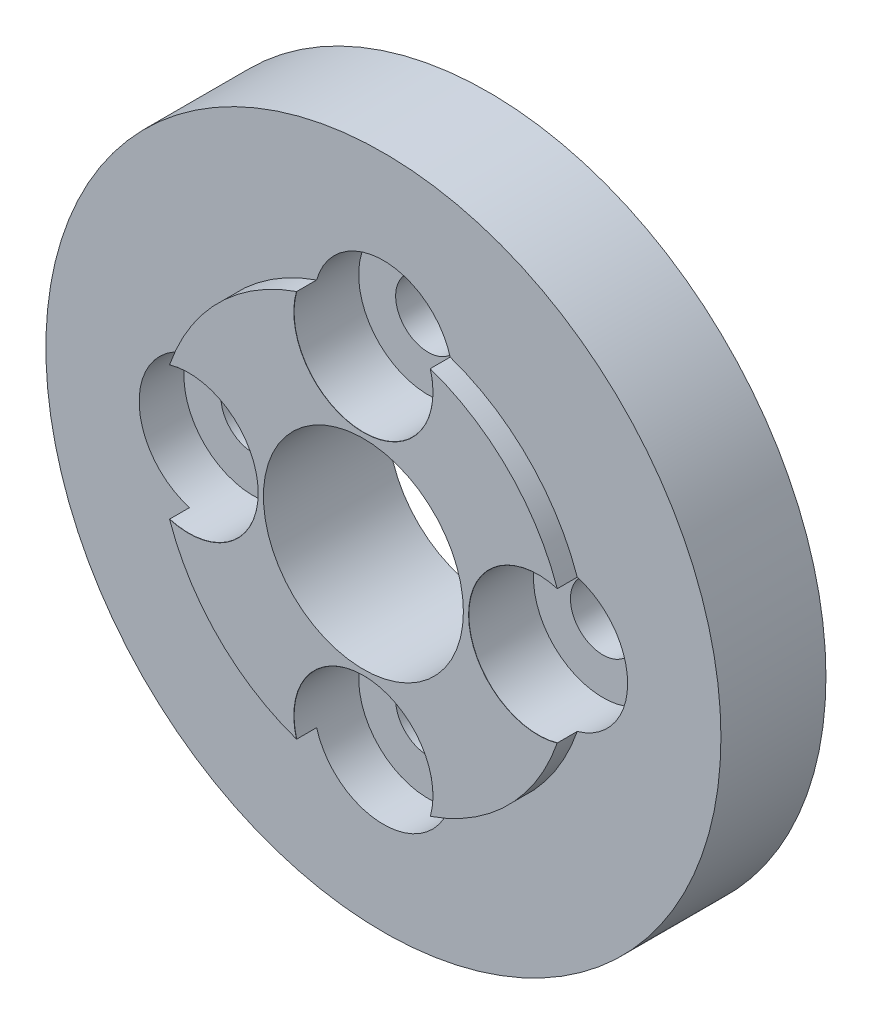
ISO-10303-21;
HEADER;
FILE_DESCRIPTION(('STEP AP214'),'2;1');
FILE_NAME('part.step','',(''),(''),'','','');
FILE_SCHEMA(('AUTOMOTIVE_DESIGN { 1 0 10303 214 1 1 1 1 }'));
ENDSEC;
DATA;
#1=APPLICATION_CONTEXT('core data for automotive mechanical design processes');
#2=APPLICATION_PROTOCOL_DEFINITION('international standard','automotive_design',2000,#1);
#3=PRODUCT_CONTEXT('',#1,'mechanical');
#4=PRODUCT('Part','Part','',(#3));
#5=PRODUCT_RELATED_PRODUCT_CATEGORY('part','',(#4));
#6=PRODUCT_DEFINITION_FORMATION('','',#4);
#7=PRODUCT_DEFINITION_CONTEXT('part definition',#1,'design');
#8=PRODUCT_DEFINITION('design','',#6,#7);
#9=PRODUCT_DEFINITION_SHAPE('','',#8);
#10=(LENGTH_UNIT() NAMED_UNIT(*) SI_UNIT(.MILLI.,.METRE.));
#11=(NAMED_UNIT(*) PLANE_ANGLE_UNIT() SI_UNIT($,.RADIAN.));
#12=(NAMED_UNIT(*) SI_UNIT($,.STERADIAN.) SOLID_ANGLE_UNIT());
#13=UNCERTAINTY_MEASURE_WITH_UNIT(LENGTH_MEASURE(1.E-05),#10,'distance_accuracy_value','');
#14=(GEOMETRIC_REPRESENTATION_CONTEXT(3) GLOBAL_UNCERTAINTY_ASSIGNED_CONTEXT((#13)) GLOBAL_UNIT_ASSIGNED_CONTEXT((#10,
#11,#12)) REPRESENTATION_CONTEXT('',''));
#15=CARTESIAN_POINT('',(0.,0.,0.));
#16=DIRECTION('',(0.,0.,1.));
#17=DIRECTION('',(1.,0.,0.));
#18=AXIS2_PLACEMENT_3D('',#15,#16,#17);
#19=CARTESIAN_POINT('',(0.,0.,25.));
#20=DIRECTION('',(0.,0.,-1.));
#21=DIRECTION('',(-1.,0.,0.));
#22=AXIS2_PLACEMENT_3D('',#19,#20,#21);
#23=CYLINDRICAL_SURFACE('',#22,41.);
#24=CARTESIAN_POINT('',(38.7535008434906,13.3852968728219,25.0002));
#25=CARTESIAN_POINT('',(38.7551865109238,13.3804164798747,24.9959662065485));
#26=CARTESIAN_POINT('',(38.7568713176971,13.3755355905067,24.9917326431561));
#27=CARTESIAN_POINT('',(38.7602392099241,13.3657728189289,24.9832659764895));
#28=CARTESIAN_POINT('',(38.7619222953778,13.3608909367192,24.9790328732152));
#29=CARTESIAN_POINT('',(38.7636045201715,13.3560085580886,24.9748));
#30=B_SPLINE_CURVE_WITH_KNOTS('',3,(#24,#25,#26,#27,#28,#29),.UNSPECIFIED.,.F.,.F.,(4,2,4),(0.,
0.0200315357612623,0.040063071522703),.UNSPECIFIED.);
#31=CARTESIAN_POINT('',(38.7535804721029,13.3850663275252,25.));
#32=VERTEX_POINT('',#31);
#33=CARTESIAN_POINT('',(38.7635250357652,13.3562392461951,24.975));
#34=VERTEX_POINT('',#33);
#35=EDGE_CURVE('E48',#32,#34,#30,.T.);
#36=ORIENTED_EDGE('',*,*,#35,.T.);
#37=DIRECTION('',(0.,0.,1.));
#38=VECTOR('',#37,1.);
#39=CARTESIAN_POINT('',(38.7635250357652,13.3562392461951,18.5125));
#40=LINE('',#39,#38);
#41=CARTESIAN_POINT('',(38.7635250357652,13.3562392461951,21.));
#42=VERTEX_POINT('',#41);
#43=EDGE_CURVE('E11',#34,#42,#40,.F.);
#44=ORIENTED_EDGE('',*,*,#43,.T.);
#45=CARTESIAN_POINT('',(0.,0.,21.));
#46=DIRECTION('',(0.,0.,1.));
#47=DIRECTION('',(1.,0.,0.));
#48=AXIS2_PLACEMENT_3D('',#45,#46,#47);
#49=CIRCLE('',#48,41.);
#50=CARTESIAN_POINT('',(13.3562392461947,38.7635250357654,21.));
#51=VERTEX_POINT('',#50);
#52=EDGE_CURVE('E286',#42,#51,#49,.T.);
#53=ORIENTED_EDGE('',*,*,#52,.T.);
#54=DIRECTION('',(0.,0.,1.));
#55=VECTOR('',#54,1.);
#56=CARTESIAN_POINT('',(13.3562392461947,38.7635250357654,18.5125));
#57=LINE('',#56,#55);
#58=CARTESIAN_POINT('',(13.3562392461947,38.7635250357654,24.975));
#59=VERTEX_POINT('',#58);
#60=EDGE_CURVE('E249',#51,#59,#57,.T.);
#61=ORIENTED_EDGE('',*,*,#60,.T.);
#62=CARTESIAN_POINT('',(13.3560085580882,38.7636045201717,24.9748));
#63=CARTESIAN_POINT('',(13.3608909367188,38.7619222953779,24.9790328732152));
#64=CARTESIAN_POINT('',(13.3657728189285,38.7602392099243,24.9832659764895));
#65=CARTESIAN_POINT('',(13.3755355905063,38.7568713176973,24.9917326431561));
#66=CARTESIAN_POINT('',(13.3804164798743,38.7551865109239,24.9959662065485));
#67=CARTESIAN_POINT('',(13.3852968728215,38.7535008434907,25.0002));
#68=B_SPLINE_CURVE_WITH_KNOTS('',3,(#62,#63,#64,#65,#66,#67),.UNSPECIFIED.,.F.,.F.,(4,2,4),(0.,
0.0200315357614394,0.0400630715226987),.UNSPECIFIED.);
#69=CARTESIAN_POINT('',(13.3850663275247,38.753580472103,25.));
#70=VERTEX_POINT('',#69);
#71=EDGE_CURVE('E261',#59,#70,#68,.T.);
#72=ORIENTED_EDGE('',*,*,#71,.T.);
#73=CARTESIAN_POINT('',(0.,0.,25.));
#74=DIRECTION('',(0.,0.,1.));
#75=DIRECTION('',(1.,0.,0.));
#76=AXIS2_PLACEMENT_3D('',#73,#74,#75);
#77=CIRCLE('',#76,41.);
#78=EDGE_CURVE('E144',#32,#70,#77,.T.);
#79=ORIENTED_EDGE('',*,*,#78,.F.);
#80=EDGE_LOOP('',(#36,#44,#53,#61,#72,#79));
#81=FACE_BOUND('',#80,.T.);
#82=ADVANCED_FACE('F39',(#81),#23,.T.);
#83=CARTESIAN_POINT('',(13.3562392461947,-38.7635250357654,21.));
#84=VERTEX_POINT('',#83);
#85=CARTESIAN_POINT('',(38.7635250357655,-13.3562392461943,21.));
#86=VERTEX_POINT('',#85);
#87=EDGE_CURVE('E377',#84,#86,#49,.T.);
#88=ORIENTED_EDGE('',*,*,#87,.T.);
#89=DIRECTION('',(0.,0.,1.));
#90=VECTOR('',#89,1.);
#91=CARTESIAN_POINT('',(38.7635250357655,-13.3562392461943,18.5125));
#92=LINE('',#91,#90);
#93=CARTESIAN_POINT('',(38.7635250357655,-13.3562392461943,24.975));
#94=VERTEX_POINT('',#93);
#95=EDGE_CURVE('E146',#86,#94,#92,.T.);
#96=ORIENTED_EDGE('',*,*,#95,.T.);
#97=CARTESIAN_POINT('',(38.7636045201718,-13.3560085580878,24.9748));
#98=CARTESIAN_POINT('',(38.761922295378,-13.3608909367184,24.9790328732152));
#99=CARTESIAN_POINT('',(38.7602392099244,-13.3657728189281,24.9832659764895));
#100=CARTESIAN_POINT('',(38.7568713176974,-13.3755355905059,24.9917326431561));
#101=CARTESIAN_POINT('',(38.7551865109241,-13.3804164798739,24.9959662065485));
#102=CARTESIAN_POINT('',(38.7535008434908,-13.3852968728211,25.0002));
#103=B_SPLINE_CURVE_WITH_KNOTS('',3,(#97,#98,#99,#100,#101,#102),.UNSPECIFIED.,.F.,.F.,(4,2,4),
(0.,0.0200315357614416,0.0400630715227),.UNSPECIFIED.);
#104=CARTESIAN_POINT('',(38.7535804721031,-13.3850663275243,25.));
#105=VERTEX_POINT('',#104);
#106=EDGE_CURVE('E138',#94,#105,#103,.T.);
#107=ORIENTED_EDGE('',*,*,#106,.T.);
#108=CARTESIAN_POINT('',(13.3850663275247,-38.753580472103,25.));
#109=VERTEX_POINT('',#108);
#110=EDGE_CURVE('E383',#109,#105,#77,.T.);
#111=ORIENTED_EDGE('',*,*,#110,.F.);
#112=CARTESIAN_POINT('',(13.3852968728215,-38.7535008434907,25.0002));
#113=CARTESIAN_POINT('',(13.3804164798743,-38.7551865109239,24.9959662065485));
#114=CARTESIAN_POINT('',(13.3755355905063,-38.7568713176973,24.9917326431561));
#115=CARTESIAN_POINT('',(13.3657728189285,-38.7602392099243,24.9832659764895));
#116=CARTESIAN_POINT('',(13.3608909367188,-38.7619222953779,24.9790328732152));
#117=CARTESIAN_POINT('',(13.3560085580882,-38.7636045201717,24.9748));
#118=B_SPLINE_CURVE_WITH_KNOTS('',3,(#112,#113,#114,#115,#116,#117),.UNSPECIFIED.,.F.,.F.,(4,2,
4),(0.,0.0200315357612606,0.0400630715227018),.UNSPECIFIED.);
#119=CARTESIAN_POINT('',(13.3562392461947,-38.7635250357654,24.975));
#120=VERTEX_POINT('',#119);
#121=EDGE_CURVE('E176',#109,#120,#118,.T.);
#122=ORIENTED_EDGE('',*,*,#121,.T.);
#123=DIRECTION('',(0.,0.,1.));
#124=VECTOR('',#123,1.);
#125=CARTESIAN_POINT('',(13.3562392461947,-38.7635250357654,18.5125));
#126=LINE('',#125,#124);
#127=EDGE_CURVE('E172',#120,#84,#126,.F.);
#128=ORIENTED_EDGE('',*,*,#127,.T.);
#129=EDGE_LOOP('',(#88,#96,#107,#111,#122,#128));
#130=FACE_BOUND('',#129,.T.);
#131=ADVANCED_FACE('F406',(#130),#23,.T.);
#132=CARTESIAN_POINT('',(-38.7635250357653,-13.3562392461948,21.));
#133=VERTEX_POINT('',#132);
#134=CARTESIAN_POINT('',(-13.3562392461947,-38.7635250357654,21.));
#135=VERTEX_POINT('',#134);
#136=EDGE_CURVE('E285',#133,#135,#49,.T.);
#137=ORIENTED_EDGE('',*,*,#136,.T.);
#138=DIRECTION('',(0.,0.,1.));
#139=VECTOR('',#138,1.);
#140=CARTESIAN_POINT('',(-13.3562392461947,-38.7635250357654,18.5125));
#141=LINE('',#140,#139);
#142=CARTESIAN_POINT('',(-13.3562392461947,-38.7635250357654,24.975));
#143=VERTEX_POINT('',#142);
#144=EDGE_CURVE('E185',#135,#143,#141,.T.);
#145=ORIENTED_EDGE('',*,*,#144,.T.);
#146=CARTESIAN_POINT('',(-13.3560085580882,-38.7636045201717,24.9748));
#147=CARTESIAN_POINT('',(-13.3608909367188,-38.7619222953779,24.9790328732152));
#148=CARTESIAN_POINT('',(-13.3657728189285,-38.7602392099243,24.9832659764895));
#149=CARTESIAN_POINT('',(-13.3755355905063,-38.7568713176973,24.9917326431561));
#150=CARTESIAN_POINT('',(-13.3804164798743,-38.7551865109239,24.9959662065485));
#151=CARTESIAN_POINT('',(-13.3852968728215,-38.7535008434907,25.0002));
#152=B_SPLINE_CURVE_WITH_KNOTS('',3,(#146,#147,#148,#149,#150,#151),.UNSPECIFIED.,.F.,.F.,(4,2,
4),(0.,0.0200315357614394,0.0400630715226987),.UNSPECIFIED.);
#153=CARTESIAN_POINT('',(-13.3850663275247,-38.753580472103,25.));
#154=VERTEX_POINT('',#153);
#155=EDGE_CURVE('E196',#143,#154,#152,.T.);
#156=ORIENTED_EDGE('',*,*,#155,.T.);
#157=CARTESIAN_POINT('',(-38.753580472103,-13.3850663275249,25.));
#158=VERTEX_POINT('',#157);
#159=EDGE_CURVE('E290',#158,#154,#77,.T.);
#160=ORIENTED_EDGE('',*,*,#159,.F.);
#161=CARTESIAN_POINT('',(-38.7535008434907,-13.3852968728217,25.0002));
#162=CARTESIAN_POINT('',(-38.7551865109239,-13.3804164798745,24.9959662065485));
#163=CARTESIAN_POINT('',(-38.7568713176972,-13.3755355905064,24.9917326431561));
#164=CARTESIAN_POINT('',(-38.7602392099242,-13.3657728189287,24.9832659764895));
#165=CARTESIAN_POINT('',(-38.7619222953779,-13.3608909367189,24.9790328732152));
#166=CARTESIAN_POINT('',(-38.7636045201716,-13.3560085580884,24.9748));
#167=B_SPLINE_CURVE_WITH_KNOTS('',3,(#161,#162,#163,#164,#165,#166),.UNSPECIFIED.,.F.,.F.,(4,2,
4),(0.,0.0200315357612606,0.0400630715227005),.UNSPECIFIED.);
#168=CARTESIAN_POINT('',(-38.7635250357653,-13.3562392461948,24.975));
#169=VERTEX_POINT('',#168);
#170=EDGE_CURVE('E207',#158,#169,#167,.T.);
#171=ORIENTED_EDGE('',*,*,#170,.T.);
#172=DIRECTION('',(0.,0.,1.));
#173=VECTOR('',#172,1.);
#174=CARTESIAN_POINT('',(-38.7635250357653,-13.3562392461948,18.5125));
#175=LINE('',#174,#173);
#176=EDGE_CURVE('E203',#169,#133,#175,.F.);
#177=ORIENTED_EDGE('',*,*,#176,.T.);
#178=EDGE_LOOP('',(#137,#145,#156,#160,#171,#177));
#179=FACE_BOUND('',#178,.T.);
#180=ADVANCED_FACE('F394',(#179),#23,.T.);
#181=CARTESIAN_POINT('',(0.,0.,21.));
#182=DIRECTION('',(0.,0.,1.));
#183=DIRECTION('',(1.,0.,0.));
#184=AXIS2_PLACEMENT_3D('',#181,#182,#183);
#185=PLANE('',#184);
#186=CARTESIAN_POINT('',(34.95,3.66081818377703E-13,21.));
#187=DIRECTION('',(0.,0.,1.));
#188=DIRECTION('',(1.,0.,0.));
#189=AXIS2_PLACEMENT_3D('',#186,#187,#188);
#190=CIRCLE('',#189,13.89);
#191=EDGE_CURVE('E133',#86,#42,#190,.T.);
#192=ORIENTED_EDGE('',*,*,#191,.F.);
#193=ORIENTED_EDGE('',*,*,#87,.F.);
#194=CARTESIAN_POINT('',(0.,-34.95,21.));
#195=DIRECTION('',(0.,0.,1.));
#196=DIRECTION('',(1.,0.,0.));
#197=AXIS2_PLACEMENT_3D('',#194,#195,#196);
#198=CIRCLE('',#197,13.89);
#199=EDGE_CURVE('E340',#135,#84,#198,.T.);
#200=ORIENTED_EDGE('',*,*,#199,.F.);
#201=ORIENTED_EDGE('',*,*,#136,.F.);
#202=CARTESIAN_POINT('',(-34.95,-1.22027272792568E-13,21.));
#203=DIRECTION('',(0.,0.,1.));
#204=DIRECTION('',(1.,0.,0.));
#205=AXIS2_PLACEMENT_3D('',#202,#203,#204);
#206=CIRCLE('',#205,13.89);
#207=CARTESIAN_POINT('',(-38.7635250357654,13.3562392461945,21.));
#208=VERTEX_POINT('',#207);
#209=EDGE_CURVE('E318',#208,#133,#206,.T.);
#210=ORIENTED_EDGE('',*,*,#209,.F.);
#211=CARTESIAN_POINT('',(-13.3562392461947,38.7635250357654,21.));
#212=VERTEX_POINT('',#211);
#213=EDGE_CURVE('E281',#212,#208,#49,.T.);
#214=ORIENTED_EDGE('',*,*,#213,.F.);
#215=CARTESIAN_POINT('',(0.,34.95,21.));
#216=DIRECTION('',(0.,0.,1.));
#217=DIRECTION('',(1.,0.,0.));
#218=AXIS2_PLACEMENT_3D('',#215,#216,#217);
#219=CIRCLE('',#218,13.89);
#220=EDGE_CURVE('E295',#51,#212,#219,.T.);
#221=ORIENTED_EDGE('',*,*,#220,.F.);
#222=ORIENTED_EDGE('',*,*,#52,.F.);
#223=EDGE_LOOP('',(#192,#193,#200,#201,#210,#214,#221,#222));
#224=FACE_BOUND('',#223,.T.);
#225=CARTESIAN_POINT('',(0.,0.,21.));
#226=DIRECTION('',(0.,0.,1.));
#227=DIRECTION('',(1.,0.,0.));
#228=AXIS2_PLACEMENT_3D('',#225,#226,#227);
#229=CIRCLE('',#228,67.5);
#230=CARTESIAN_POINT('',(67.5,0.,21.));
#231=VERTEX_POINT('',#230);
#232=EDGE_CURVE('E268',#231,#231,#229,.T.);
#233=ORIENTED_EDGE('',*,*,#232,.T.);
#234=EDGE_LOOP('',(#233));
#235=FACE_BOUND('',#234,.T.);
#236=ADVANCED_FACE('F402',(#224,#235),#185,.T.);
#237=CARTESIAN_POINT('',(0.,0.,0.));
#238=DIRECTION('',(0.,0.,1.));
#239=DIRECTION('',(1.,0.,0.));
#240=AXIS2_PLACEMENT_3D('',#237,#238,#239);
#241=PLANE('',#240);
#242=CARTESIAN_POINT('',(34.95,3.66081818377703E-13,0.));
#243=DIRECTION('',(0.,0.,1.));
#244=DIRECTION('',(1.,0.,0.));
#245=AXIS2_PLACEMENT_3D('',#242,#243,#244);
#246=CIRCLE('',#245,6.49999999999999);
#247=CARTESIAN_POINT('',(41.45,3.66081818377703E-13,0.));
#248=VERTEX_POINT('',#247);
#249=EDGE_CURVE('E363',#248,#248,#246,.T.);
#250=ORIENTED_EDGE('',*,*,#249,.T.);
#251=EDGE_LOOP('',(#250));
#252=FACE_BOUND('',#251,.T.);
#253=CARTESIAN_POINT('',(0.,-34.95,0.));
#254=DIRECTION('',(0.,0.,1.));
#255=DIRECTION('',(1.,0.,0.));
#256=AXIS2_PLACEMENT_3D('',#253,#254,#255);
#257=CIRCLE('',#256,6.49999999999999);
#258=CARTESIAN_POINT('',(6.49999999999999,-34.95,0.));
#259=VERTEX_POINT('',#258);
#260=EDGE_CURVE('E343',#259,#259,#257,.T.);
#261=ORIENTED_EDGE('',*,*,#260,.T.);
#262=EDGE_LOOP('',(#261));
#263=FACE_BOUND('',#262,.T.);
#264=CARTESIAN_POINT('',(-34.95,-1.22027272792568E-13,0.));
#265=DIRECTION('',(0.,0.,1.));
#266=DIRECTION('',(1.,0.,0.));
#267=AXIS2_PLACEMENT_3D('',#264,#265,#266);
#268=CIRCLE('',#267,6.5);
#269=CARTESIAN_POINT('',(-28.45,-1.22027272792568E-13,0.));
#270=VERTEX_POINT('',#269);
#271=EDGE_CURVE('E321',#270,#270,#268,.T.);
#272=ORIENTED_EDGE('',*,*,#271,.T.);
#273=EDGE_LOOP('',(#272));
#274=FACE_BOUND('',#273,.T.);
#275=CARTESIAN_POINT('',(0.,34.95,0.));
#276=DIRECTION('',(0.,0.,1.));
#277=DIRECTION('',(1.,0.,0.));
#278=AXIS2_PLACEMENT_3D('',#275,#276,#277);
#279=CIRCLE('',#278,6.49999999999999);
#280=CARTESIAN_POINT('',(6.49999999999999,34.95,0.));
#281=VERTEX_POINT('',#280);
#282=EDGE_CURVE('E298',#281,#281,#279,.T.);
#283=ORIENTED_EDGE('',*,*,#282,.T.);
#284=EDGE_LOOP('',(#283));
#285=FACE_BOUND('',#284,.T.);
#286=CARTESIAN_POINT('',(0.,0.,0.));
#287=DIRECTION('',(0.,0.,1.));
#288=DIRECTION('',(1.,0.,0.));
#289=AXIS2_PLACEMENT_3D('',#286,#287,#288);
#290=CIRCLE('',#289,67.5);
#291=CARTESIAN_POINT('',(67.5,0.,0.));
#292=VERTEX_POINT('',#291);
#293=EDGE_CURVE('E269',#292,#292,#290,.T.);
#294=ORIENTED_EDGE('',*,*,#293,.F.);
#295=EDGE_LOOP('',(#294));
#296=FACE_BOUND('',#295,.T.);
#297=CARTESIAN_POINT('',(0.,0.,0.));
#298=DIRECTION('',(0.,0.,1.));
#299=DIRECTION('',(1.,0.,0.));
#300=AXIS2_PLACEMENT_3D('',#297,#298,#299);
#301=CIRCLE('',#300,20.);
#302=CARTESIAN_POINT('',(20.,0.,0.));
#303=VERTEX_POINT('',#302);
#304=EDGE_CURVE('E273',#303,#303,#301,.T.);
#305=ORIENTED_EDGE('',*,*,#304,.T.);
#306=EDGE_LOOP('',(#305));
#307=FACE_BOUND('',#306,.T.);
#308=ADVANCED_FACE('F438',(#252,#263,#274,#285,#296,#307),#241,.F.);
#309=CARTESIAN_POINT('',(0.,0.,21.));
#310=DIRECTION('',(0.,0.,-1.));
#311=DIRECTION('',(-1.,0.,0.));
#312=AXIS2_PLACEMENT_3D('',#309,#310,#311);
#313=CYLINDRICAL_SURFACE('',#312,67.5);
#314=ORIENTED_EDGE('',*,*,#232,.F.);
#315=EDGE_LOOP('',(#314));
#316=FACE_BOUND('',#315,.T.);
#317=ORIENTED_EDGE('',*,*,#293,.T.);
#318=EDGE_LOOP('',(#317));
#319=FACE_BOUND('',#318,.T.);
#320=ADVANCED_FACE('F41',(#316,#319),#313,.T.);
#321=CARTESIAN_POINT('',(0.,0.,21.));
#322=DIRECTION('',(0.,0.,-1.));
#323=DIRECTION('',(-1.,0.,0.));
#324=AXIS2_PLACEMENT_3D('',#321,#322,#323);
#325=CYLINDRICAL_SURFACE('',#324,20.);
#326=ORIENTED_EDGE('',*,*,#304,.F.);
#327=EDGE_LOOP('',(#326));
#328=FACE_BOUND('',#327,.T.);
#329=CARTESIAN_POINT('',(0.,0.,25.));
#330=DIRECTION('',(0.,0.,1.));
#331=DIRECTION('',(1.,0.,0.));
#332=AXIS2_PLACEMENT_3D('',#329,#330,#331);
#333=CIRCLE('',#332,20.);
#334=CARTESIAN_POINT('',(20.,0.,25.));
#335=VERTEX_POINT('',#334);
#336=EDGE_CURVE('E291',#335,#335,#333,.T.);
#337=ORIENTED_EDGE('',*,*,#336,.T.);
#338=EDGE_LOOP('',(#337));
#339=FACE_BOUND('',#338,.T.);
#340=ADVANCED_FACE('F444',(#328,#339),#325,.F.);
#341=CARTESIAN_POINT('',(0.,0.,25.));
#342=DIRECTION('',(0.,0.,1.));
#343=DIRECTION('',(1.,0.,0.));
#344=AXIS2_PLACEMENT_3D('',#341,#342,#343);
#345=PLANE('',#344);
#346=CARTESIAN_POINT('',(34.95,3.66081818377703E-13,25.));
#347=DIRECTION('',(0.,0.,1.));
#348=DIRECTION('',(1.,0.,0.));
#349=AXIS2_PLACEMENT_3D('',#346,#347,#348);
#350=CIRCLE('',#349,13.915);
#351=EDGE_CURVE('E55',#32,#105,#350,.T.);
#352=ORIENTED_EDGE('',*,*,#351,.F.);
#353=ORIENTED_EDGE('',*,*,#78,.T.);
#354=CARTESIAN_POINT('',(0.,34.95,25.));
#355=DIRECTION('',(0.,0.,1.));
#356=DIRECTION('',(1.,0.,0.));
#357=AXIS2_PLACEMENT_3D('',#354,#355,#356);
#358=CIRCLE('',#357,13.915);
#359=CARTESIAN_POINT('',(-13.3850663275247,38.753580472103,25.));
#360=VERTEX_POINT('',#359);
#361=EDGE_CURVE('E314',#360,#70,#358,.T.);
#362=ORIENTED_EDGE('',*,*,#361,.F.);
#363=CARTESIAN_POINT('',(-38.7535804721031,13.3850663275246,25.));
#364=VERTEX_POINT('',#363);
#365=EDGE_CURVE('E280',#360,#364,#77,.T.);
#366=ORIENTED_EDGE('',*,*,#365,.T.);
#367=CARTESIAN_POINT('',(-34.95,-1.22027272792568E-13,25.));
#368=DIRECTION('',(0.,0.,1.));
#369=DIRECTION('',(1.,0.,0.));
#370=AXIS2_PLACEMENT_3D('',#367,#368,#369);
#371=CIRCLE('',#370,13.915);
#372=EDGE_CURVE('E337',#158,#364,#371,.T.);
#373=ORIENTED_EDGE('',*,*,#372,.F.);
#374=ORIENTED_EDGE('',*,*,#159,.T.);
#375=CARTESIAN_POINT('',(0.,-34.95,25.));
#376=DIRECTION('',(0.,0.,1.));
#377=DIRECTION('',(1.,0.,0.));
#378=AXIS2_PLACEMENT_3D('',#375,#376,#377);
#379=CIRCLE('',#378,13.915);
#380=EDGE_CURVE('E63',#109,#154,#379,.T.);
#381=ORIENTED_EDGE('',*,*,#380,.F.);
#382=ORIENTED_EDGE('',*,*,#110,.T.);
#383=EDGE_LOOP('',(#352,#353,#362,#366,#373,#374,#381,#382));
#384=FACE_BOUND('',#383,.T.);
#385=ORIENTED_EDGE('',*,*,#336,.F.);
#386=EDGE_LOOP('',(#385));
#387=FACE_BOUND('',#386,.T.);
#388=ADVANCED_FACE('F409',(#384,#387),#345,.T.);
#389=ORIENTED_EDGE('',*,*,#213,.T.);
#390=DIRECTION('',(0.,0.,1.));
#391=VECTOR('',#390,1.);
#392=CARTESIAN_POINT('',(-38.7635250357654,13.3562392461945,18.5125));
#393=LINE('',#392,#391);
#394=CARTESIAN_POINT('',(-38.7635250357654,13.3562392461945,24.975));
#395=VERTEX_POINT('',#394);
#396=EDGE_CURVE('E216',#208,#395,#393,.T.);
#397=ORIENTED_EDGE('',*,*,#396,.T.);
#398=CARTESIAN_POINT('',(-38.7636045201717,13.3560085580881,24.9748));
#399=CARTESIAN_POINT('',(-38.7619222953779,13.3608909367187,24.9790328732152));
#400=CARTESIAN_POINT('',(-38.7602392099243,13.3657728189284,24.9832659764895));
#401=CARTESIAN_POINT('',(-38.7568713176973,13.3755355905062,24.9917326431561));
#402=CARTESIAN_POINT('',(-38.755186510924,13.3804164798742,24.9959662065485));
#403=CARTESIAN_POINT('',(-38.7535008434908,13.3852968728214,25.0002));
#404=B_SPLINE_CURVE_WITH_KNOTS('',3,(#398,#399,#400,#401,#402,#403),.UNSPECIFIED.,.F.,.F.,(4,2,
4),(0.,0.0200315357614399,0.0400630715227009),.UNSPECIFIED.);
#405=EDGE_CURVE('E228',#395,#364,#404,.T.);
#406=ORIENTED_EDGE('',*,*,#405,.T.);
#407=ORIENTED_EDGE('',*,*,#365,.F.);
#408=CARTESIAN_POINT('',(-13.3852968728215,38.7535008434907,25.0002));
#409=CARTESIAN_POINT('',(-13.3804164798743,38.7551865109239,24.9959662065485));
#410=CARTESIAN_POINT('',(-13.3755355905063,38.7568713176973,24.9917326431561));
#411=CARTESIAN_POINT('',(-13.3657728189285,38.7602392099243,24.9832659764895));
#412=CARTESIAN_POINT('',(-13.3608909367188,38.7619222953779,24.9790328732152));
#413=CARTESIAN_POINT('',(-13.3560085580882,38.7636045201717,24.9748));
#414=B_SPLINE_CURVE_WITH_KNOTS('',3,(#408,#409,#410,#411,#412,#413),.UNSPECIFIED.,.F.,.F.,(4,2,
4),(0.,0.0200315357612606,0.0400630715227018),.UNSPECIFIED.);
#415=CARTESIAN_POINT('',(-13.3562392461947,38.7635250357654,24.975));
#416=VERTEX_POINT('',#415);
#417=EDGE_CURVE('E240',#360,#416,#414,.T.);
#418=ORIENTED_EDGE('',*,*,#417,.T.);
#419=DIRECTION('',(0.,0.,1.));
#420=VECTOR('',#419,1.);
#421=CARTESIAN_POINT('',(-13.3562392461947,38.7635250357654,18.5125));
#422=LINE('',#421,#420);
#423=EDGE_CURVE('E236',#416,#212,#422,.F.);
#424=ORIENTED_EDGE('',*,*,#423,.T.);
#425=EDGE_LOOP('',(#389,#397,#406,#407,#418,#424));
#426=FACE_BOUND('',#425,.T.);
#427=ADVANCED_FACE('F156',(#426),#23,.T.);
#428=CARTESIAN_POINT('',(0.,34.95,25.));
#429=DIRECTION('',(0.,0.,1.));
#430=DIRECTION('',(1.,0.,0.));
#431=AXIS2_PLACEMENT_3D('',#428,#429,#430);
#432=CYLINDRICAL_SURFACE('',#431,13.89);
#433=CARTESIAN_POINT('',(0.,34.95,12.05));
#434=DIRECTION('',(0.,0.,1.));
#435=DIRECTION('',(1.,0.,0.));
#436=AXIS2_PLACEMENT_3D('',#433,#434,#435);
#437=CIRCLE('',#436,13.89);
#438=CARTESIAN_POINT('',(13.89,34.95,12.05));
#439=VERTEX_POINT('',#438);
#440=EDGE_CURVE('E306',#439,#439,#437,.T.);
#441=ORIENTED_EDGE('',*,*,#440,.F.);
#442=EDGE_LOOP('',(#441));
#443=FACE_BOUND('',#442,.T.);
#444=ORIENTED_EDGE('',*,*,#220,.T.);
#445=ORIENTED_EDGE('',*,*,#423,.F.);
#446=CARTESIAN_POINT('',(0.,34.95,24.975));
#447=DIRECTION('',(0.,0.,1.));
#448=DIRECTION('',(1.,0.,0.));
#449=AXIS2_PLACEMENT_3D('',#446,#447,#448);
#450=CIRCLE('',#449,13.89);
#451=EDGE_CURVE('E310',#416,#59,#450,.T.);
#452=ORIENTED_EDGE('',*,*,#451,.T.);
#453=ORIENTED_EDGE('',*,*,#60,.F.);
#454=EDGE_LOOP('',(#444,#445,#452,#453));
#455=FACE_BOUND('',#454,.T.);
#456=ADVANCED_FACE('F257',(#443,#455),#432,.F.);
#457=CARTESIAN_POINT('',(0.,34.95,25.));
#458=DIRECTION('',(0.,0.,1.));
#459=DIRECTION('',(1.,0.,0.));
#460=AXIS2_PLACEMENT_3D('',#457,#458,#459);
#461=CONICAL_SURFACE('',#460,13.915,0.785398163397483);
#462=ORIENTED_EDGE('',*,*,#361,.T.);
#463=ORIENTED_EDGE('',*,*,#71,.F.);
#464=ORIENTED_EDGE('',*,*,#451,.F.);
#465=ORIENTED_EDGE('',*,*,#417,.F.);
#466=EDGE_LOOP('',(#462,#463,#464,#465));
#467=FACE_BOUND('',#466,.T.);
#468=ADVANCED_FACE('F251',(#467),#461,.F.);
#469=CARTESIAN_POINT('',(0.,34.95,25.));
#470=DIRECTION('',(0.,0.,1.));
#471=DIRECTION('',(1.,0.,0.));
#472=AXIS2_PLACEMENT_3D('',#469,#470,#471);
#473=CYLINDRICAL_SURFACE('',#472,6.5);
#474=ORIENTED_EDGE('',*,*,#282,.F.);
#475=EDGE_LOOP('',(#474));
#476=FACE_BOUND('',#475,.T.);
#477=CARTESIAN_POINT('',(0.,34.95,12.05));
#478=DIRECTION('',(0.,0.,1.));
#479=DIRECTION('',(1.,0.,0.));
#480=AXIS2_PLACEMENT_3D('',#477,#478,#479);
#481=CIRCLE('',#480,6.5);
#482=CARTESIAN_POINT('',(6.5,34.95,12.05));
#483=VERTEX_POINT('',#482);
#484=EDGE_CURVE('E302',#483,#483,#481,.T.);
#485=ORIENTED_EDGE('',*,*,#484,.T.);
#486=EDGE_LOOP('',(#485));
#487=FACE_BOUND('',#486,.T.);
#488=ADVANCED_FACE('F256',(#476,#487),#473,.F.);
#489=CARTESIAN_POINT('',(13.89,34.95,12.05));
#490=DIRECTION('',(0.,0.,-1.));
#491=DIRECTION('',(-1.,0.,0.));
#492=AXIS2_PLACEMENT_3D('',#489,#490,#491);
#493=PLANE('',#492);
#494=ORIENTED_EDGE('',*,*,#484,.F.);
#495=EDGE_LOOP('',(#494));
#496=FACE_BOUND('',#495,.T.);
#497=ORIENTED_EDGE('',*,*,#440,.T.);
#498=EDGE_LOOP('',(#497));
#499=FACE_BOUND('',#498,.T.);
#500=ADVANCED_FACE('F491',(#496,#499),#493,.F.);
#501=CARTESIAN_POINT('',(-34.95,-1.22027272792568E-13,25.));
#502=DIRECTION('',(0.,0.,1.));
#503=DIRECTION('',(1.,0.,0.));
#504=AXIS2_PLACEMENT_3D('',#501,#502,#503);
#505=CYLINDRICAL_SURFACE('',#504,13.89);
#506=CARTESIAN_POINT('',(-34.95,-1.22027272792568E-13,12.05));
#507=DIRECTION('',(0.,0.,1.));
#508=DIRECTION('',(1.,0.,0.));
#509=AXIS2_PLACEMENT_3D('',#506,#507,#508);
#510=CIRCLE('',#509,13.89);
#511=CARTESIAN_POINT('',(-21.06,-1.22027272792568E-13,12.05));
#512=VERTEX_POINT('',#511);
#513=EDGE_CURVE('E329',#512,#512,#510,.T.);
#514=ORIENTED_EDGE('',*,*,#513,.F.);
#515=EDGE_LOOP('',(#514));
#516=FACE_BOUND('',#515,.T.);
#517=ORIENTED_EDGE('',*,*,#209,.T.);
#518=ORIENTED_EDGE('',*,*,#176,.F.);
#519=CARTESIAN_POINT('',(-34.95,-1.22027272792568E-13,24.975));
#520=DIRECTION('',(0.,0.,1.));
#521=DIRECTION('',(1.,0.,0.));
#522=AXIS2_PLACEMENT_3D('',#519,#520,#521);
#523=CIRCLE('',#522,13.89);
#524=EDGE_CURVE('E333',#169,#395,#523,.T.);
#525=ORIENTED_EDGE('',*,*,#524,.T.);
#526=ORIENTED_EDGE('',*,*,#396,.F.);
#527=EDGE_LOOP('',(#517,#518,#525,#526));
#528=FACE_BOUND('',#527,.T.);
#529=ADVANCED_FACE('F224',(#516,#528),#505,.F.);
#530=CARTESIAN_POINT('',(-34.95,-1.22027272792568E-13,25.));
#531=DIRECTION('',(0.,0.,1.));
#532=DIRECTION('',(1.,0.,0.));
#533=AXIS2_PLACEMENT_3D('',#530,#531,#532);
#534=CONICAL_SURFACE('',#533,13.915,0.785398163397448);
#535=ORIENTED_EDGE('',*,*,#372,.T.);
#536=ORIENTED_EDGE('',*,*,#405,.F.);
#537=ORIENTED_EDGE('',*,*,#524,.F.);
#538=ORIENTED_EDGE('',*,*,#170,.F.);
#539=EDGE_LOOP('',(#535,#536,#537,#538));
#540=FACE_BOUND('',#539,.T.);
#541=ADVANCED_FACE('F218',(#540),#534,.F.);
#542=CARTESIAN_POINT('',(-34.95,-1.22027272792568E-13,25.));
#543=DIRECTION('',(0.,0.,1.));
#544=DIRECTION('',(1.,0.,0.));
#545=AXIS2_PLACEMENT_3D('',#542,#543,#544);
#546=CYLINDRICAL_SURFACE('',#545,6.5);
#547=ORIENTED_EDGE('',*,*,#271,.F.);
#548=EDGE_LOOP('',(#547));
#549=FACE_BOUND('',#548,.T.);
#550=CARTESIAN_POINT('',(-34.95,-1.22027272792568E-13,12.05));
#551=DIRECTION('',(0.,0.,1.));
#552=DIRECTION('',(1.,0.,0.));
#553=AXIS2_PLACEMENT_3D('',#550,#551,#552);
#554=CIRCLE('',#553,6.5);
#555=CARTESIAN_POINT('',(-28.45,-1.22027272792568E-13,12.05));
#556=VERTEX_POINT('',#555);
#557=EDGE_CURVE('E325',#556,#556,#554,.T.);
#558=ORIENTED_EDGE('',*,*,#557,.T.);
#559=EDGE_LOOP('',(#558));
#560=FACE_BOUND('',#559,.T.);
#561=ADVANCED_FACE('F223',(#549,#560),#546,.F.);
#562=CARTESIAN_POINT('',(-21.06,-1.22027272792568E-13,12.05));
#563=DIRECTION('',(0.,0.,-1.));
#564=DIRECTION('',(-1.,0.,0.));
#565=AXIS2_PLACEMENT_3D('',#562,#563,#564);
#566=PLANE('',#565);
#567=ORIENTED_EDGE('',*,*,#557,.F.);
#568=EDGE_LOOP('',(#567));
#569=FACE_BOUND('',#568,.T.);
#570=ORIENTED_EDGE('',*,*,#513,.T.);
#571=EDGE_LOOP('',(#570));
#572=FACE_BOUND('',#571,.T.);
#573=ADVANCED_FACE('F508',(#569,#572),#566,.F.);
#574=CARTESIAN_POINT('',(0.,-34.95,25.));
#575=DIRECTION('',(0.,0.,1.));
#576=DIRECTION('',(1.,0.,0.));
#577=AXIS2_PLACEMENT_3D('',#574,#575,#576);
#578=CYLINDRICAL_SURFACE('',#577,13.89);
#579=CARTESIAN_POINT('',(0.,-34.95,12.05));
#580=DIRECTION('',(0.,0.,1.));
#581=DIRECTION('',(1.,0.,0.));
#582=AXIS2_PLACEMENT_3D('',#579,#580,#581);
#583=CIRCLE('',#582,13.89);
#584=CARTESIAN_POINT('',(13.89,-34.95,12.05));
#585=VERTEX_POINT('',#584);
#586=EDGE_CURVE('E351',#585,#585,#583,.T.);
#587=ORIENTED_EDGE('',*,*,#586,.F.);
#588=EDGE_LOOP('',(#587));
#589=FACE_BOUND('',#588,.T.);
#590=ORIENTED_EDGE('',*,*,#199,.T.);
#591=ORIENTED_EDGE('',*,*,#127,.F.);
#592=CARTESIAN_POINT('',(0.,-34.95,24.975));
#593=DIRECTION('',(0.,0.,1.));
#594=DIRECTION('',(1.,0.,0.));
#595=AXIS2_PLACEMENT_3D('',#592,#593,#594);
#596=CIRCLE('',#595,13.89);
#597=EDGE_CURVE('E355',#120,#143,#596,.T.);
#598=ORIENTED_EDGE('',*,*,#597,.T.);
#599=ORIENTED_EDGE('',*,*,#144,.F.);
#600=EDGE_LOOP('',(#590,#591,#598,#599));
#601=FACE_BOUND('',#600,.T.);
#602=ADVANCED_FACE('F193',(#589,#601),#578,.F.);
#603=CARTESIAN_POINT('',(0.,-34.95,25.));
#604=DIRECTION('',(0.,0.,1.));
#605=DIRECTION('',(1.,0.,0.));
#606=AXIS2_PLACEMENT_3D('',#603,#604,#605);
#607=CONICAL_SURFACE('',#606,13.915,0.785398163397483);
#608=ORIENTED_EDGE('',*,*,#380,.T.);
#609=ORIENTED_EDGE('',*,*,#155,.F.);
#610=ORIENTED_EDGE('',*,*,#597,.F.);
#611=ORIENTED_EDGE('',*,*,#121,.F.);
#612=EDGE_LOOP('',(#608,#609,#610,#611));
#613=FACE_BOUND('',#612,.T.);
#614=ADVANCED_FACE('F187',(#613),#607,.F.);
#615=CARTESIAN_POINT('',(0.,-34.95,25.));
#616=DIRECTION('',(0.,0.,1.));
#617=DIRECTION('',(1.,0.,0.));
#618=AXIS2_PLACEMENT_3D('',#615,#616,#617);
#619=CYLINDRICAL_SURFACE('',#618,6.5);
#620=ORIENTED_EDGE('',*,*,#260,.F.);
#621=EDGE_LOOP('',(#620));
#622=FACE_BOUND('',#621,.T.);
#623=CARTESIAN_POINT('',(0.,-34.95,12.05));
#624=DIRECTION('',(0.,0.,1.));
#625=DIRECTION('',(1.,0.,0.));
#626=AXIS2_PLACEMENT_3D('',#623,#624,#625);
#627=CIRCLE('',#626,6.5);
#628=CARTESIAN_POINT('',(6.5,-34.95,12.05));
#629=VERTEX_POINT('',#628);
#630=EDGE_CURVE('E347',#629,#629,#627,.T.);
#631=ORIENTED_EDGE('',*,*,#630,.T.);
#632=EDGE_LOOP('',(#631));
#633=FACE_BOUND('',#632,.T.);
#634=ADVANCED_FACE('F192',(#622,#633),#619,.F.);
#635=CARTESIAN_POINT('',(13.89,-34.95,12.05));
#636=DIRECTION('',(0.,0.,-1.));
#637=DIRECTION('',(-1.,0.,0.));
#638=AXIS2_PLACEMENT_3D('',#635,#636,#637);
#639=PLANE('',#638);
#640=ORIENTED_EDGE('',*,*,#630,.F.);
#641=EDGE_LOOP('',(#640));
#642=FACE_BOUND('',#641,.T.);
#643=ORIENTED_EDGE('',*,*,#586,.T.);
#644=EDGE_LOOP('',(#643));
#645=FACE_BOUND('',#644,.T.);
#646=ADVANCED_FACE('F539',(#642,#645),#639,.F.);
#647=CARTESIAN_POINT('',(34.95,3.66081818377703E-13,25.));
#648=DIRECTION('',(0.,0.,1.));
#649=DIRECTION('',(1.,0.,0.));
#650=AXIS2_PLACEMENT_3D('',#647,#648,#649);
#651=CYLINDRICAL_SURFACE('',#650,13.89);
#652=CARTESIAN_POINT('',(34.95,3.66081818377703E-13,12.05));
#653=DIRECTION('',(0.,0.,1.));
#654=DIRECTION('',(1.,0.,0.));
#655=AXIS2_PLACEMENT_3D('',#652,#653,#654);
#656=CIRCLE('',#655,13.89);
#657=CARTESIAN_POINT('',(48.84,3.66081818377703E-13,12.05));
#658=VERTEX_POINT('',#657);
#659=EDGE_CURVE('E140',#658,#658,#656,.T.);
#660=ORIENTED_EDGE('',*,*,#659,.F.);
#661=EDGE_LOOP('',(#660));
#662=FACE_BOUND('',#661,.T.);
#663=ORIENTED_EDGE('',*,*,#191,.T.);
#664=ORIENTED_EDGE('',*,*,#43,.F.);
#665=CARTESIAN_POINT('',(34.95,3.66081818377703E-13,24.975));
#666=DIRECTION('',(0.,0.,1.));
#667=DIRECTION('',(1.,0.,0.));
#668=AXIS2_PLACEMENT_3D('',#665,#666,#667);
#669=CIRCLE('',#668,13.89);
#670=EDGE_CURVE('E130',#34,#94,#669,.T.);
#671=ORIENTED_EDGE('',*,*,#670,.T.);
#672=ORIENTED_EDGE('',*,*,#95,.F.);
#673=EDGE_LOOP('',(#663,#664,#671,#672));
#674=FACE_BOUND('',#673,.T.);
#675=ADVANCED_FACE('F129',(#662,#674),#651,.F.);
#676=CARTESIAN_POINT('',(34.95,3.66081818377703E-13,25.));
#677=DIRECTION('',(0.,0.,1.));
#678=DIRECTION('',(1.,0.,0.));
#679=AXIS2_PLACEMENT_3D('',#676,#677,#678);
#680=CONICAL_SURFACE('',#679,13.915,0.785398163397518);
#681=ORIENTED_EDGE('',*,*,#351,.T.);
#682=ORIENTED_EDGE('',*,*,#106,.F.);
#683=ORIENTED_EDGE('',*,*,#670,.F.);
#684=ORIENTED_EDGE('',*,*,#35,.F.);
#685=EDGE_LOOP('',(#681,#682,#683,#684));
#686=FACE_BOUND('',#685,.T.);
#687=ADVANCED_FACE('F137',(#686),#680,.F.);
#688=CARTESIAN_POINT('',(34.95,3.66081818377703E-13,25.));
#689=DIRECTION('',(0.,0.,1.));
#690=DIRECTION('',(1.,0.,0.));
#691=AXIS2_PLACEMENT_3D('',#688,#689,#690);
#692=CYLINDRICAL_SURFACE('',#691,6.5);
#693=ORIENTED_EDGE('',*,*,#249,.F.);
#694=EDGE_LOOP('',(#693));
#695=FACE_BOUND('',#694,.T.);
#696=CARTESIAN_POINT('',(34.95,3.66081818377703E-13,12.05));
#697=DIRECTION('',(0.,0.,1.));
#698=DIRECTION('',(1.,0.,0.));
#699=AXIS2_PLACEMENT_3D('',#696,#697,#698);
#700=CIRCLE('',#699,6.5);
#701=CARTESIAN_POINT('',(41.45,3.66081818377703E-13,12.05));
#702=VERTEX_POINT('',#701);
#703=EDGE_CURVE('E367',#702,#702,#700,.T.);
#704=ORIENTED_EDGE('',*,*,#703,.T.);
#705=EDGE_LOOP('',(#704));
#706=FACE_BOUND('',#705,.T.);
#707=ADVANCED_FACE('F163',(#695,#706),#692,.F.);
#708=CARTESIAN_POINT('',(48.84,3.66081818377703E-13,12.05));
#709=DIRECTION('',(0.,0.,-1.));
#710=DIRECTION('',(-1.,0.,0.));
#711=AXIS2_PLACEMENT_3D('',#708,#709,#710);
#712=PLANE('',#711);
#713=ORIENTED_EDGE('',*,*,#703,.F.);
#714=EDGE_LOOP('',(#713));
#715=FACE_BOUND('',#714,.T.);
#716=ORIENTED_EDGE('',*,*,#659,.T.);
#717=EDGE_LOOP('',(#716));
#718=FACE_BOUND('',#717,.T.);
#719=ADVANCED_FACE('F570',(#715,#718),#712,.F.);
#720=CLOSED_SHELL('',(#82,#131,#180,#236,#308,#320,#340,#388,#427,#456,#468,#488,#500,#529,#541,
#561,#573,#602,#614,#634,#646,#675,#687,#707,#719));
#721=MANIFOLD_SOLID_BREP('B2',#720);
#722=ADVANCED_BREP_SHAPE_REPRESENTATION('',(#18,#721),#14);
#723=SHAPE_DEFINITION_REPRESENTATION(#9,#722);
ENDSEC;
END-ISO-10303-21;
